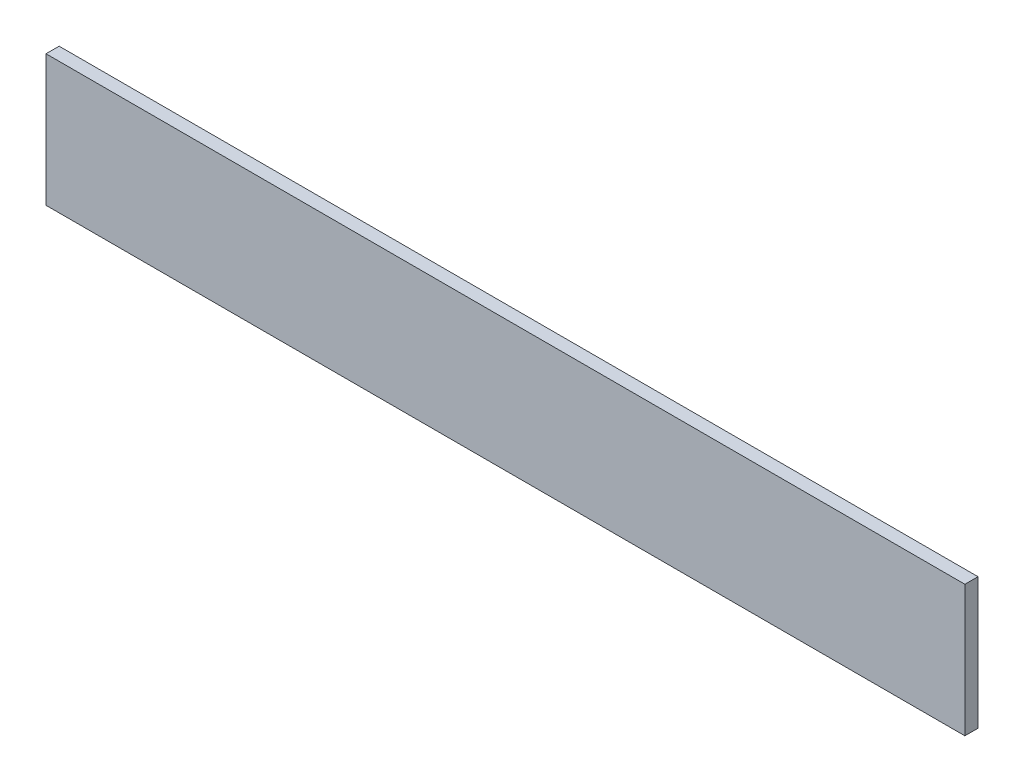
ISO-10303-21;
HEADER;
FILE_DESCRIPTION(('STEP AP214'),'2;1');
FILE_NAME('part.step','',(''),(''),'','','');
FILE_SCHEMA(('AUTOMOTIVE_DESIGN { 1 0 10303 214 1 1 1 1 }'));
ENDSEC;
DATA;
#1=APPLICATION_CONTEXT('core data for automotive mechanical design processes');
#2=APPLICATION_PROTOCOL_DEFINITION('international standard','automotive_design',2000,#1);
#3=PRODUCT_CONTEXT('',#1,'mechanical');
#4=PRODUCT('Part','Part','',(#3));
#5=PRODUCT_RELATED_PRODUCT_CATEGORY('part','',(#4));
#6=PRODUCT_DEFINITION_FORMATION('','',#4);
#7=PRODUCT_DEFINITION_CONTEXT('part definition',#1,'design');
#8=PRODUCT_DEFINITION('design','',#6,#7);
#9=PRODUCT_DEFINITION_SHAPE('','',#8);
#10=(LENGTH_UNIT() NAMED_UNIT(*) SI_UNIT(.MILLI.,.METRE.));
#11=(NAMED_UNIT(*) PLANE_ANGLE_UNIT() SI_UNIT($,.RADIAN.));
#12=(NAMED_UNIT(*) SI_UNIT($,.STERADIAN.) SOLID_ANGLE_UNIT());
#13=UNCERTAINTY_MEASURE_WITH_UNIT(LENGTH_MEASURE(1.E-05),#10,'distance_accuracy_value','');
#14=(GEOMETRIC_REPRESENTATION_CONTEXT(3) GLOBAL_UNCERTAINTY_ASSIGNED_CONTEXT((#13)) GLOBAL_UNIT_ASSIGNED_CONTEXT((#10,
#11,#12)) REPRESENTATION_CONTEXT('',''));
#15=CARTESIAN_POINT('',(0.,0.,0.));
#16=DIRECTION('',(0.,0.,1.));
#17=DIRECTION('',(1.,0.,0.));
#18=AXIS2_PLACEMENT_3D('',#15,#16,#17);
#19=CARTESIAN_POINT('',(0.,0.,2.));
#20=DIRECTION('',(1.,0.,0.));
#21=DIRECTION('',(0.,1.,0.));
#22=AXIS2_PLACEMENT_3D('',#19,#20,#21);
#23=PLANE('',#22);
#24=DIRECTION('',(0.,-1.,0.));
#25=VECTOR('',#24,1.);
#26=CARTESIAN_POINT('',(0.,0.,0.));
#27=LINE('',#26,#25);
#28=CARTESIAN_POINT('',(0.,0.,0.));
#29=VERTEX_POINT('',#28);
#30=CARTESIAN_POINT('',(0.,-20.,0.));
#31=VERTEX_POINT('',#30);
#32=EDGE_CURVE('E100',#29,#31,#27,.T.);
#33=ORIENTED_EDGE('',*,*,#32,.T.);
#34=DIRECTION('',(0.,0.,-1.));
#35=VECTOR('',#34,1.);
#36=CARTESIAN_POINT('',(0.,-20.,2.));
#37=LINE('',#36,#35);
#38=CARTESIAN_POINT('',(0.,-20.,2.));
#39=VERTEX_POINT('',#38);
#40=EDGE_CURVE('E11',#39,#31,#37,.T.);
#41=ORIENTED_EDGE('',*,*,#40,.F.);
#42=DIRECTION('',(0.,-1.,0.));
#43=VECTOR('',#42,1.);
#44=CARTESIAN_POINT('',(0.,0.,2.));
#45=LINE('',#44,#43);
#46=CARTESIAN_POINT('',(0.,0.,2.));
#47=VERTEX_POINT('',#46);
#48=EDGE_CURVE('E88',#47,#39,#45,.T.);
#49=ORIENTED_EDGE('',*,*,#48,.F.);
#50=DIRECTION('',(0.,0.,-1.));
#51=VECTOR('',#50,1.);
#52=CARTESIAN_POINT('',(0.,0.,2.));
#53=LINE('',#52,#51);
#54=EDGE_CURVE('E96',#47,#29,#53,.T.);
#55=ORIENTED_EDGE('',*,*,#54,.T.);
#56=EDGE_LOOP('',(#33,#41,#49,#55));
#57=FACE_BOUND('',#56,.T.);
#58=ADVANCED_FACE('F37',(#57),#23,.F.);
#59=CARTESIAN_POINT('',(0.,-20.,2.));
#60=DIRECTION('',(0.,1.,0.));
#61=DIRECTION('',(0.,0.,1.));
#62=AXIS2_PLACEMENT_3D('',#59,#60,#61);
#63=PLANE('',#62);
#64=DIRECTION('',(1.,0.,0.));
#65=VECTOR('',#64,1.);
#66=CARTESIAN_POINT('',(0.,-20.,0.));
#67=LINE('',#66,#65);
#68=CARTESIAN_POINT('',(140.,-20.,0.));
#69=VERTEX_POINT('',#68);
#70=EDGE_CURVE('E92',#31,#69,#67,.T.);
#71=ORIENTED_EDGE('',*,*,#70,.T.);
#72=DIRECTION('',(0.,0.,-1.));
#73=VECTOR('',#72,1.);
#74=CARTESIAN_POINT('',(140.,-20.,2.));
#75=LINE('',#74,#73);
#76=CARTESIAN_POINT('',(140.,-20.,2.));
#77=VERTEX_POINT('',#76);
#78=EDGE_CURVE('E45',#77,#69,#75,.T.);
#79=ORIENTED_EDGE('',*,*,#78,.F.);
#80=DIRECTION('',(1.,0.,0.));
#81=VECTOR('',#80,1.);
#82=CARTESIAN_POINT('',(0.,-20.,2.));
#83=LINE('',#82,#81);
#84=EDGE_CURVE('E83',#39,#77,#83,.T.);
#85=ORIENTED_EDGE('',*,*,#84,.F.);
#86=ORIENTED_EDGE('',*,*,#40,.T.);
#87=EDGE_LOOP('',(#71,#79,#85,#86));
#88=FACE_BOUND('',#87,.T.);
#89=ADVANCED_FACE('F91',(#88),#63,.F.);
#90=CARTESIAN_POINT('',(140.,0.,2.));
#91=DIRECTION('',(-1.,0.,0.));
#92=DIRECTION('',(0.,0.,1.));
#93=AXIS2_PLACEMENT_3D('',#90,#91,#92);
#94=PLANE('',#93);
#95=DIRECTION('',(0.,1.,0.));
#96=VECTOR('',#95,1.);
#97=CARTESIAN_POINT('',(140.,0.,0.));
#98=LINE('',#97,#96);
#99=CARTESIAN_POINT('',(140.,0.,0.));
#100=VERTEX_POINT('',#99);
#101=EDGE_CURVE('E70',#69,#100,#98,.T.);
#102=ORIENTED_EDGE('',*,*,#101,.T.);
#103=DIRECTION('',(0.,0.,-1.));
#104=VECTOR('',#103,1.);
#105=CARTESIAN_POINT('',(140.,0.,2.));
#106=LINE('',#105,#104);
#107=CARTESIAN_POINT('',(140.,0.,2.));
#108=VERTEX_POINT('',#107);
#109=EDGE_CURVE('E93',#108,#100,#106,.T.);
#110=ORIENTED_EDGE('',*,*,#109,.F.);
#111=DIRECTION('',(0.,1.,0.));
#112=VECTOR('',#111,1.);
#113=CARTESIAN_POINT('',(140.,0.,2.));
#114=LINE('',#113,#112);
#115=EDGE_CURVE('E86',#77,#108,#114,.T.);
#116=ORIENTED_EDGE('',*,*,#115,.F.);
#117=ORIENTED_EDGE('',*,*,#78,.T.);
#118=EDGE_LOOP('',(#102,#110,#116,#117));
#119=FACE_BOUND('',#118,.T.);
#120=ADVANCED_FACE('F94',(#119),#94,.F.);
#121=CARTESIAN_POINT('',(0.,0.,2.));
#122=DIRECTION('',(0.,-1.,0.));
#123=DIRECTION('',(0.,0.,-1.));
#124=AXIS2_PLACEMENT_3D('',#121,#122,#123);
#125=PLANE('',#124);
#126=DIRECTION('',(-1.,0.,0.));
#127=VECTOR('',#126,1.);
#128=CARTESIAN_POINT('',(0.,0.,0.));
#129=LINE('',#128,#127);
#130=EDGE_CURVE('E76',#100,#29,#129,.T.);
#131=ORIENTED_EDGE('',*,*,#130,.T.);
#132=ORIENTED_EDGE('',*,*,#54,.F.);
#133=DIRECTION('',(-1.,0.,0.));
#134=VECTOR('',#133,1.);
#135=CARTESIAN_POINT('',(0.,0.,2.));
#136=LINE('',#135,#134);
#137=EDGE_CURVE('E53',#108,#47,#136,.T.);
#138=ORIENTED_EDGE('',*,*,#137,.F.);
#139=ORIENTED_EDGE('',*,*,#109,.T.);
#140=EDGE_LOOP('',(#131,#132,#138,#139));
#141=FACE_BOUND('',#140,.T.);
#142=ADVANCED_FACE('F107',(#141),#125,.F.);
#143=CARTESIAN_POINT('',(0.,0.,2.));
#144=DIRECTION('',(0.,0.,1.));
#145=DIRECTION('',(1.,0.,0.));
#146=AXIS2_PLACEMENT_3D('',#143,#144,#145);
#147=PLANE('',#146);
#148=ORIENTED_EDGE('',*,*,#48,.T.);
#149=ORIENTED_EDGE('',*,*,#84,.T.);
#150=ORIENTED_EDGE('',*,*,#115,.T.);
#151=ORIENTED_EDGE('',*,*,#137,.T.);
#152=EDGE_LOOP('',(#148,#149,#150,#151));
#153=FACE_BOUND('',#152,.T.);
#154=ADVANCED_FACE('F84',(#153),#147,.T.);
#155=CARTESIAN_POINT('',(0.,0.,0.));
#156=DIRECTION('',(0.,0.,1.));
#157=DIRECTION('',(1.,0.,0.));
#158=AXIS2_PLACEMENT_3D('',#155,#156,#157);
#159=PLANE('',#158);
#160=ORIENTED_EDGE('',*,*,#32,.F.);
#161=ORIENTED_EDGE('',*,*,#130,.F.);
#162=ORIENTED_EDGE('',*,*,#101,.F.);
#163=ORIENTED_EDGE('',*,*,#70,.F.);
#164=EDGE_LOOP('',(#160,#161,#162,#163));
#165=FACE_BOUND('',#164,.T.);
#166=ADVANCED_FACE('F110',(#165),#159,.F.);
#167=CLOSED_SHELL('',(#58,#89,#120,#142,#154,#166));
#168=MANIFOLD_SOLID_BREP('B2',#167);
#169=ADVANCED_BREP_SHAPE_REPRESENTATION('',(#18,#168),#14);
#170=SHAPE_DEFINITION_REPRESENTATION(#9,#169);
ENDSEC;
END-ISO-10303-21;
